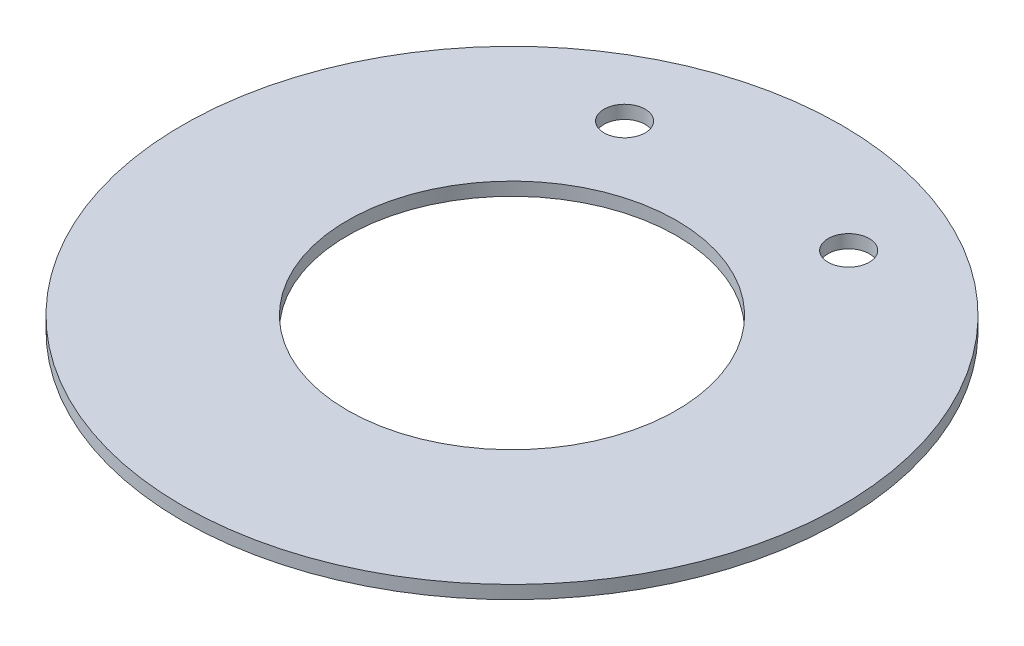
ISO-10303-21;
HEADER;
FILE_DESCRIPTION(('STEP AP214'),'2;1');
FILE_NAME('part.step','',(''),(''),'','','');
FILE_SCHEMA(('AUTOMOTIVE_DESIGN { 1 0 10303 214 1 1 1 1 }'));
ENDSEC;
DATA;
#1=APPLICATION_CONTEXT('core data for automotive mechanical design processes');
#2=APPLICATION_PROTOCOL_DEFINITION('international standard','automotive_design',2000,#1);
#3=PRODUCT_CONTEXT('',#1,'mechanical');
#4=PRODUCT('Part','Part','',(#3));
#5=PRODUCT_RELATED_PRODUCT_CATEGORY('part','',(#4));
#6=PRODUCT_DEFINITION_FORMATION('','',#4);
#7=PRODUCT_DEFINITION_CONTEXT('part definition',#1,'design');
#8=PRODUCT_DEFINITION('design','',#6,#7);
#9=PRODUCT_DEFINITION_SHAPE('','',#8);
#10=(LENGTH_UNIT() NAMED_UNIT(*) SI_UNIT(.MILLI.,.METRE.));
#11=(NAMED_UNIT(*) PLANE_ANGLE_UNIT() SI_UNIT($,.RADIAN.));
#12=(NAMED_UNIT(*) SI_UNIT($,.STERADIAN.) SOLID_ANGLE_UNIT());
#13=UNCERTAINTY_MEASURE_WITH_UNIT(LENGTH_MEASURE(1.E-05),#10,'distance_accuracy_value','');
#14=(GEOMETRIC_REPRESENTATION_CONTEXT(3) GLOBAL_UNCERTAINTY_ASSIGNED_CONTEXT((#13)) GLOBAL_UNIT_ASSIGNED_CONTEXT((#10,
#11,#12)) REPRESENTATION_CONTEXT('',''));
#15=CARTESIAN_POINT('',(0.,0.,0.));
#16=DIRECTION('',(0.,0.,1.));
#17=DIRECTION('',(1.,0.,0.));
#18=AXIS2_PLACEMENT_3D('',#15,#16,#17);
#19=CARTESIAN_POINT('',(0.,3.175,0.));
#20=DIRECTION('',(0.,1.,0.));
#21=DIRECTION('',(0.,0.,1.));
#22=AXIS2_PLACEMENT_3D('',#19,#20,#21);
#23=PLANE('',#22);
#24=CARTESIAN_POINT('',(26.9875,3.175,-54.102));
#25=DIRECTION('',(0.,1.,0.));
#26=DIRECTION('',(0.,0.,1.));
#27=AXIS2_PLACEMENT_3D('',#24,#25,#26);
#28=CIRCLE('',#27,4.95299999999998);
#29=CARTESIAN_POINT('',(26.9875,3.175,-49.149));
#30=VERTEX_POINT('',#29);
#31=EDGE_CURVE('E60',#30,#30,#28,.T.);
#32=ORIENTED_EDGE('',*,*,#31,.F.);
#33=EDGE_LOOP('',(#32));
#34=FACE_BOUND('',#33,.T.);
#35=CARTESIAN_POINT('',(-26.9875,3.175,-54.102));
#36=DIRECTION('',(0.,1.,0.));
#37=DIRECTION('',(0.,0.,1.));
#38=AXIS2_PLACEMENT_3D('',#35,#36,#37);
#39=CIRCLE('',#38,4.95299999999999);
#40=CARTESIAN_POINT('',(-26.9875,3.175,-49.149));
#41=VERTEX_POINT('',#40);
#42=EDGE_CURVE('E57',#41,#41,#39,.T.);
#43=ORIENTED_EDGE('',*,*,#42,.F.);
#44=EDGE_LOOP('',(#43));
#45=FACE_BOUND('',#44,.T.);
#46=CARTESIAN_POINT('',(0.,3.175,0.));
#47=DIRECTION('',(0.,1.,0.));
#48=DIRECTION('',(0.,0.,1.));
#49=AXIS2_PLACEMENT_3D('',#46,#47,#48);
#50=CIRCLE('',#49,79.375);
#51=CARTESIAN_POINT('',(0.,3.175,79.375));
#52=VERTEX_POINT('',#51);
#53=EDGE_CURVE('E10',#52,#52,#50,.T.);
#54=ORIENTED_EDGE('',*,*,#53,.T.);
#55=EDGE_LOOP('',(#54));
#56=FACE_BOUND('',#55,.T.);
#57=CARTESIAN_POINT('',(0.,3.175,0.));
#58=DIRECTION('',(0.,1.,0.));
#59=DIRECTION('',(0.,0.,1.));
#60=AXIS2_PLACEMENT_3D('',#57,#58,#59);
#61=CIRCLE('',#60,39.624);
#62=CARTESIAN_POINT('',(0.,3.175,39.624));
#63=VERTEX_POINT('',#62);
#64=EDGE_CURVE('E46',#63,#63,#61,.T.);
#65=ORIENTED_EDGE('',*,*,#64,.F.);
#66=EDGE_LOOP('',(#65));
#67=FACE_BOUND('',#66,.T.);
#68=ADVANCED_FACE('F35',(#34,#45,#56,#67),#23,.T.);
#69=CARTESIAN_POINT('',(0.,0.,0.));
#70=DIRECTION('',(0.,1.,0.));
#71=DIRECTION('',(0.,0.,1.));
#72=AXIS2_PLACEMENT_3D('',#69,#70,#71);
#73=PLANE('',#72);
#74=CARTESIAN_POINT('',(26.9875,0.,-54.102));
#75=DIRECTION('',(0.,1.,0.));
#76=DIRECTION('',(0.,0.,1.));
#77=AXIS2_PLACEMENT_3D('',#74,#75,#76);
#78=CIRCLE('',#77,4.95299999999998);
#79=CARTESIAN_POINT('',(26.9875,0.,-49.149));
#80=VERTEX_POINT('',#79);
#81=EDGE_CURVE('E51',#80,#80,#78,.T.);
#82=ORIENTED_EDGE('',*,*,#81,.T.);
#83=EDGE_LOOP('',(#82));
#84=FACE_BOUND('',#83,.T.);
#85=CARTESIAN_POINT('',(-26.9875,0.,-54.102));
#86=DIRECTION('',(0.,1.,0.));
#87=DIRECTION('',(0.,0.,1.));
#88=AXIS2_PLACEMENT_3D('',#85,#86,#87);
#89=CIRCLE('',#88,4.95299999999999);
#90=CARTESIAN_POINT('',(-26.9875,0.,-49.149));
#91=VERTEX_POINT('',#90);
#92=EDGE_CURVE('E54',#91,#91,#89,.T.);
#93=ORIENTED_EDGE('',*,*,#92,.T.);
#94=EDGE_LOOP('',(#93));
#95=FACE_BOUND('',#94,.T.);
#96=CARTESIAN_POINT('',(0.,0.,0.));
#97=DIRECTION('',(0.,1.,0.));
#98=DIRECTION('',(0.,0.,1.));
#99=AXIS2_PLACEMENT_3D('',#96,#97,#98);
#100=CIRCLE('',#99,79.375);
#101=CARTESIAN_POINT('',(0.,0.,79.375));
#102=VERTEX_POINT('',#101);
#103=EDGE_CURVE('E39',#102,#102,#100,.T.);
#104=ORIENTED_EDGE('',*,*,#103,.F.);
#105=EDGE_LOOP('',(#104));
#106=FACE_BOUND('',#105,.T.);
#107=CARTESIAN_POINT('',(0.,0.,0.));
#108=DIRECTION('',(0.,1.,0.));
#109=DIRECTION('',(0.,0.,1.));
#110=AXIS2_PLACEMENT_3D('',#107,#108,#109);
#111=CIRCLE('',#110,39.624);
#112=CARTESIAN_POINT('',(0.,0.,39.624));
#113=VERTEX_POINT('',#112);
#114=EDGE_CURVE('E48',#113,#113,#111,.T.);
#115=ORIENTED_EDGE('',*,*,#114,.T.);
#116=EDGE_LOOP('',(#115));
#117=FACE_BOUND('',#116,.T.);
#118=ADVANCED_FACE('F66',(#84,#95,#106,#117),#73,.F.);
#119=CARTESIAN_POINT('',(0.,3.175,0.));
#120=DIRECTION('',(0.,-1.,0.));
#121=DIRECTION('',(0.,0.,-1.));
#122=AXIS2_PLACEMENT_3D('',#119,#120,#121);
#123=CYLINDRICAL_SURFACE('',#122,79.375);
#124=ORIENTED_EDGE('',*,*,#53,.F.);
#125=EDGE_LOOP('',(#124));
#126=FACE_BOUND('',#125,.T.);
#127=ORIENTED_EDGE('',*,*,#103,.T.);
#128=EDGE_LOOP('',(#127));
#129=FACE_BOUND('',#128,.T.);
#130=ADVANCED_FACE('F37',(#126,#129),#123,.T.);
#131=CARTESIAN_POINT('',(0.,3.175,0.));
#132=DIRECTION('',(0.,-1.,0.));
#133=DIRECTION('',(0.,0.,-1.));
#134=AXIS2_PLACEMENT_3D('',#131,#132,#133);
#135=CYLINDRICAL_SURFACE('',#134,39.624);
#136=ORIENTED_EDGE('',*,*,#64,.T.);
#137=EDGE_LOOP('',(#136));
#138=FACE_BOUND('',#137,.T.);
#139=ORIENTED_EDGE('',*,*,#114,.F.);
#140=EDGE_LOOP('',(#139));
#141=FACE_BOUND('',#140,.T.);
#142=ADVANCED_FACE('F83',(#138,#141),#135,.F.);
#143=CARTESIAN_POINT('',(-26.9875,0.,-54.102));
#144=DIRECTION('',(0.,1.,0.));
#145=DIRECTION('',(0.,0.,1.));
#146=AXIS2_PLACEMENT_3D('',#143,#144,#145);
#147=CYLINDRICAL_SURFACE('',#146,4.95299999999999);
#148=ORIENTED_EDGE('',*,*,#92,.F.);
#149=EDGE_LOOP('',(#148));
#150=FACE_BOUND('',#149,.T.);
#151=ORIENTED_EDGE('',*,*,#42,.T.);
#152=EDGE_LOOP('',(#151));
#153=FACE_BOUND('',#152,.T.);
#154=ADVANCED_FACE('F72',(#150,#153),#147,.F.);
#155=CARTESIAN_POINT('',(26.9875,0.,-54.102));
#156=DIRECTION('',(0.,1.,0.));
#157=DIRECTION('',(0.,0.,1.));
#158=AXIS2_PLACEMENT_3D('',#155,#156,#157);
#159=CYLINDRICAL_SURFACE('',#158,4.95299999999998);
#160=ORIENTED_EDGE('',*,*,#81,.F.);
#161=EDGE_LOOP('',(#160));
#162=FACE_BOUND('',#161,.T.);
#163=ORIENTED_EDGE('',*,*,#31,.T.);
#164=EDGE_LOOP('',(#163));
#165=FACE_BOUND('',#164,.T.);
#166=ADVANCED_FACE('F69',(#162,#165),#159,.F.);
#167=CLOSED_SHELL('',(#68,#118,#130,#142,#154,#166));
#168=MANIFOLD_SOLID_BREP('B2',#167);
#169=ADVANCED_BREP_SHAPE_REPRESENTATION('',(#18,#168),#14);
#170=SHAPE_DEFINITION_REPRESENTATION(#9,#169);
ENDSEC;
END-ISO-10303-21;
